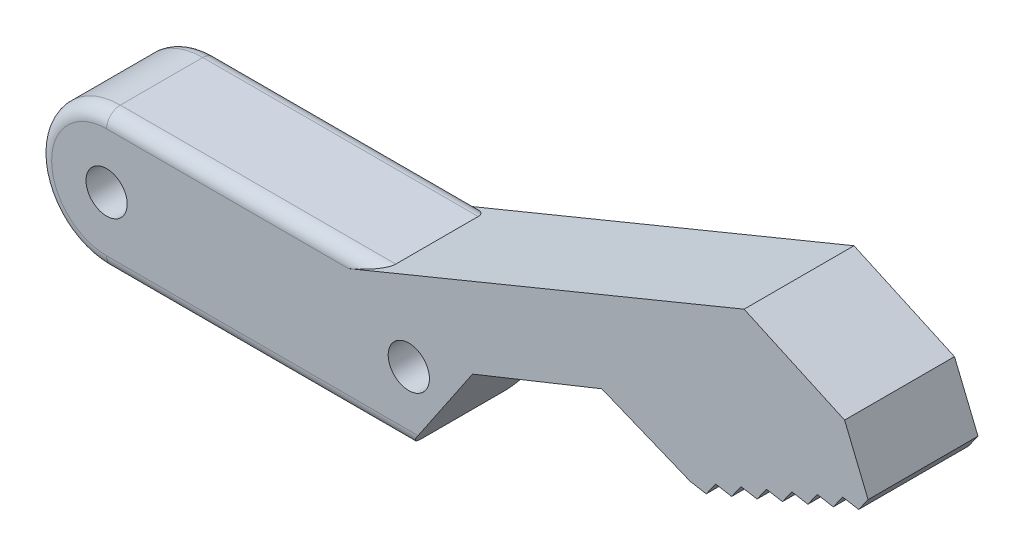
ISO-10303-21;
HEADER;
FILE_DESCRIPTION(('STEP AP214'),'2;1');
FILE_NAME('part.step','',(''),(''),'','','');
FILE_SCHEMA(('AUTOMOTIVE_DESIGN { 1 0 10303 214 1 1 1 1 }'));
ENDSEC;
DATA;
#1=APPLICATION_CONTEXT('core data for automotive mechanical design processes');
#2=APPLICATION_PROTOCOL_DEFINITION('international standard','automotive_design',2000,#1);
#3=PRODUCT_CONTEXT('',#1,'mechanical');
#4=PRODUCT('Part','Part','',(#3));
#5=PRODUCT_RELATED_PRODUCT_CATEGORY('part','',(#4));
#6=PRODUCT_DEFINITION_FORMATION('','',#4);
#7=PRODUCT_DEFINITION_CONTEXT('part definition',#1,'design');
#8=PRODUCT_DEFINITION('design','',#6,#7);
#9=PRODUCT_DEFINITION_SHAPE('','',#8);
#10=(LENGTH_UNIT() NAMED_UNIT(*) SI_UNIT(.MILLI.,.METRE.));
#11=(NAMED_UNIT(*) PLANE_ANGLE_UNIT() SI_UNIT($,.RADIAN.));
#12=(NAMED_UNIT(*) SI_UNIT($,.STERADIAN.) SOLID_ANGLE_UNIT());
#13=UNCERTAINTY_MEASURE_WITH_UNIT(LENGTH_MEASURE(1.E-05),#10,'distance_accuracy_value','');
#14=(GEOMETRIC_REPRESENTATION_CONTEXT(3) GLOBAL_UNCERTAINTY_ASSIGNED_CONTEXT((#13)) GLOBAL_UNIT_ASSIGNED_CONTEXT((#10,
#11,#12)) REPRESENTATION_CONTEXT('',''));
#15=CARTESIAN_POINT('',(0.,0.,0.));
#16=DIRECTION('',(0.,0.,1.));
#17=DIRECTION('',(1.,0.,0.));
#18=AXIS2_PLACEMENT_3D('',#15,#16,#17);
#19=CARTESIAN_POINT('',(17.4169423320841,-11.7775455324514,8.));
#20=DIRECTION('',(0.828382811153468,-0.560162403402333,0.));
#21=DIRECTION('',(0.560162403402333,0.828382811153468,0.));
#22=AXIS2_PLACEMENT_3D('',#19,#20,#21);
#23=PLANE('',#22);
#24=DIRECTION('',(-0.560162403402333,-0.828382811153468,0.));
#25=VECTOR('',#24,1.);
#26=CARTESIAN_POINT('',(17.4169423320841,-11.7775455324514,8.));
#27=LINE('',#26,#25);
#28=CARTESIAN_POINT('',(26.6402890643291,1.86218081814518,8.));
#29=VERTEX_POINT('',#28);
#30=CARTESIAN_POINT('',(22.6762120071304,-4.,8.));
#31=VERTEX_POINT('',#30);
#32=EDGE_CURVE('E224',#29,#31,#27,.T.);
#33=ORIENTED_EDGE('',*,*,#32,.T.);
#34=CARTESIAN_POINT('',(22.6762120071304,-4.,7.));
#35=DIRECTION('',(0.828382811153468,-0.560162403402333,0.));
#36=DIRECTION('',(-0.560162403402333,-0.828382811153468,0.));
#37=AXIS2_PLACEMENT_3D('',#34,#35,#36);
#38=ELLIPSE('',#37,1.2071713542771,1.);
#39=CARTESIAN_POINT('',(22.,-5.,7.));
#40=VERTEX_POINT('',#39);
#41=EDGE_CURVE('E503',#31,#40,#38,.T.);
#42=ORIENTED_EDGE('',*,*,#41,.T.);
#43=DIRECTION('',(0.,0.,-1.));
#44=VECTOR('',#43,1.);
#45=CARTESIAN_POINT('',(22.,-5.,8.));
#46=LINE('',#45,#44);
#47=CARTESIAN_POINT('',(22.,-5.,1.));
#48=VERTEX_POINT('',#47);
#49=EDGE_CURVE('E323',#40,#48,#46,.T.);
#50=ORIENTED_EDGE('',*,*,#49,.T.);
#51=CARTESIAN_POINT('',(22.6762120071304,-4.,1.));
#52=DIRECTION('',(0.828382811153468,-0.560162403402333,0.));
#53=DIRECTION('',(0.560162403402333,0.828382811153468,0.));
#54=AXIS2_PLACEMENT_3D('',#51,#52,#53);
#55=ELLIPSE('',#54,1.2071713542771,1.);
#56=CARTESIAN_POINT('',(22.6762120071304,-4.,0.));
#57=VERTEX_POINT('',#56);
#58=EDGE_CURVE('E500',#48,#57,#55,.T.);
#59=ORIENTED_EDGE('',*,*,#58,.T.);
#60=DIRECTION('',(-0.560162403402333,-0.828382811153468,0.));
#61=VECTOR('',#60,1.);
#62=CARTESIAN_POINT('',(17.4169423320841,-11.7775455324514,0.));
#63=LINE('',#62,#61);
#64=CARTESIAN_POINT('',(26.6402890643291,1.86218081814518,0.));
#65=VERTEX_POINT('',#64);
#66=EDGE_CURVE('E227',#65,#57,#63,.T.);
#67=ORIENTED_EDGE('',*,*,#66,.F.);
#68=DIRECTION('',(0.,0.,-1.));
#69=VECTOR('',#68,1.);
#70=CARTESIAN_POINT('',(26.6402890643291,1.86218081814518,8.));
#71=LINE('',#70,#69);
#72=EDGE_CURVE('E222',#29,#65,#71,.T.);
#73=ORIENTED_EDGE('',*,*,#72,.F.);
#74=EDGE_LOOP('',(#33,#42,#50,#59,#67,#73));
#75=FACE_BOUND('',#74,.T.);
#76=ADVANCED_FACE('F40',(#75),#23,.T.);
#77=CARTESIAN_POINT('',(3.05159131153168,-7.60413041189335,8.));
#78=DIRECTION('',(0.372436163629035,-0.928057812865819,0.));
#79=DIRECTION('',(0.928057812865819,0.372436163629035,0.));
#80=AXIS2_PLACEMENT_3D('',#77,#78,#79);
#81=PLANE('',#80);
#82=DIRECTION('',(-0.928057812865819,-0.372436163629035,0.));
#83=VECTOR('',#82,1.);
#84=CARTESIAN_POINT('',(3.05159131153168,-7.60413041189335,0.));
#85=LINE('',#84,#83);
#86=CARTESIAN_POINT('',(36.0495613416878,5.63818832644809,0.));
#87=VERTEX_POINT('',#86);
#88=EDGE_CURVE('E335',#87,#65,#85,.T.);
#89=ORIENTED_EDGE('',*,*,#88,.F.);
#90=DIRECTION('',(0.,0.,-1.));
#91=VECTOR('',#90,1.);
#92=CARTESIAN_POINT('',(36.0495613416878,5.63818832644809,8.));
#93=LINE('',#92,#91);
#94=CARTESIAN_POINT('',(36.0495613416878,5.63818832644809,8.));
#95=VERTEX_POINT('',#94);
#96=EDGE_CURVE('E234',#95,#87,#93,.T.);
#97=ORIENTED_EDGE('',*,*,#96,.F.);
#98=DIRECTION('',(-0.928057812865819,-0.372436163629035,0.));
#99=VECTOR('',#98,1.);
#100=CARTESIAN_POINT('',(3.05159131153168,-7.60413041189335,8.));
#101=LINE('',#100,#99);
#102=EDGE_CURVE('E241',#95,#29,#101,.T.);
#103=ORIENTED_EDGE('',*,*,#102,.T.);
#104=ORIENTED_EDGE('',*,*,#72,.T.);
#105=EDGE_LOOP('',(#89,#97,#103,#104));
#106=FACE_BOUND('',#105,.T.);
#107=ADVANCED_FACE('F248',(#106),#81,.T.);
#108=CARTESIAN_POINT('',(7.08534886984038,17.4193969684519,8.));
#109=DIRECTION('',(-0.37677497239331,-0.926304820336168,0.));
#110=DIRECTION('',(0.926304820336168,-0.37677497239331,0.));
#111=AXIS2_PLACEMENT_3D('',#108,#109,#110);
#112=PLANE('',#111);
#113=DIRECTION('',(-0.926304820336168,0.37677497239331,0.));
#114=VECTOR('',#113,1.);
#115=CARTESIAN_POINT('',(7.08534886984038,17.4193969684519,0.));
#116=LINE('',#115,#114);
#117=CARTESIAN_POINT('',(42.4889751127142,3.01895339152997,0.));
#118=VERTEX_POINT('',#117);
#119=EDGE_CURVE('E338',#118,#87,#116,.T.);
#120=ORIENTED_EDGE('',*,*,#119,.F.);
#121=DIRECTION('',(0.,0.,-1.));
#122=VECTOR('',#121,1.);
#123=CARTESIAN_POINT('',(42.4889751127142,3.01895339152997,8.));
#124=LINE('',#123,#122);
#125=CARTESIAN_POINT('',(42.4889751127142,3.01895339152997,8.));
#126=VERTEX_POINT('',#125);
#127=EDGE_CURVE('E481',#126,#118,#124,.T.);
#128=ORIENTED_EDGE('',*,*,#127,.F.);
#129=DIRECTION('',(-0.926304820336168,0.37677497239331,0.));
#130=VECTOR('',#129,1.);
#131=CARTESIAN_POINT('',(7.08534886984038,17.4193969684519,8.));
#132=LINE('',#131,#130);
#133=EDGE_CURVE('E250',#126,#95,#132,.T.);
#134=ORIENTED_EDGE('',*,*,#133,.T.);
#135=ORIENTED_EDGE('',*,*,#96,.T.);
#136=EDGE_LOOP('',(#120,#128,#134,#135));
#137=FACE_BOUND('',#136,.T.);
#138=ADVANCED_FACE('F635',(#137),#112,.T.);
#139=CARTESIAN_POINT('',(1.75554094448233,10.0994552397873,8.));
#140=DIRECTION('',(-0.171257275030365,-0.985226342395073,0.));
#141=DIRECTION('',(0.985226342395073,-0.171257275030365,0.));
#142=AXIS2_PLACEMENT_3D('',#139,#140,#141);
#143=PLANE('',#142);
#144=DIRECTION('',(-0.985226342395073,0.171257275030365,0.));
#145=VECTOR('',#144,1.);
#146=CARTESIAN_POINT('',(1.75554094448233,10.0994552397873,0.));
#147=LINE('',#146,#145);
#148=CARTESIAN_POINT('',(43.6534192909026,2.81654352051825,0.));
#149=VERTEX_POINT('',#148);
#150=EDGE_CURVE('E342',#149,#118,#147,.T.);
#151=ORIENTED_EDGE('',*,*,#150,.F.);
#152=DIRECTION('',(0.,0.,-1.));
#153=VECTOR('',#152,1.);
#154=CARTESIAN_POINT('',(43.6534192909026,2.81654352051825,8.));
#155=LINE('',#154,#153);
#156=CARTESIAN_POINT('',(43.6534192909026,2.81654352051825,8.));
#157=VERTEX_POINT('',#156);
#158=EDGE_CURVE('E478',#157,#149,#155,.T.);
#159=ORIENTED_EDGE('',*,*,#158,.F.);
#160=DIRECTION('',(-0.985226342395073,0.171257275030365,0.));
#161=VECTOR('',#160,1.);
#162=CARTESIAN_POINT('',(1.75554094448233,10.0994552397873,8.));
#163=LINE('',#162,#161);
#164=EDGE_CURVE('E253',#157,#126,#163,.T.);
#165=ORIENTED_EDGE('',*,*,#164,.T.);
#166=ORIENTED_EDGE('',*,*,#127,.T.);
#167=EDGE_LOOP('',(#151,#159,#165,#166));
#168=FACE_BOUND('',#167,.T.);
#169=ADVANCED_FACE('F632',(#168),#143,.T.);
#170=CARTESIAN_POINT('',(27.6460976469595,-19.6754472329708,8.));
#171=DIRECTION('',(0.814732571298572,-0.579836905746105,0.));
#172=DIRECTION('',(0.579836905746105,0.814732571298572,0.));
#173=AXIS2_PLACEMENT_3D('',#170,#171,#172);
#174=PLANE('',#173);
#175=DIRECTION('',(-0.579836905746105,-0.814732571298572,0.));
#176=VECTOR('',#175,1.);
#177=CARTESIAN_POINT('',(27.6460976469595,-19.6754472329708,0.));
#178=LINE('',#177,#176);
#179=CARTESIAN_POINT('',(44.3387315690473,3.77948021699638,0.));
#180=VERTEX_POINT('',#179);
#181=EDGE_CURVE('E346',#180,#149,#178,.T.);
#182=ORIENTED_EDGE('',*,*,#181,.F.);
#183=DIRECTION('',(0.,0.,-1.));
#184=VECTOR('',#183,1.);
#185=CARTESIAN_POINT('',(44.3387315690473,3.77948021699638,8.));
#186=LINE('',#185,#184);
#187=CARTESIAN_POINT('',(44.3387315690473,3.77948021699638,8.));
#188=VERTEX_POINT('',#187);
#189=EDGE_CURVE('E475',#188,#180,#186,.T.);
#190=ORIENTED_EDGE('',*,*,#189,.F.);
#191=DIRECTION('',(-0.579836905746105,-0.814732571298572,0.));
#192=VECTOR('',#191,1.);
#193=CARTESIAN_POINT('',(27.6460976469595,-19.6754472329708,8.));
#194=LINE('',#193,#192);
#195=EDGE_CURVE('E260',#188,#157,#194,.T.);
#196=ORIENTED_EDGE('',*,*,#195,.T.);
#197=ORIENTED_EDGE('',*,*,#158,.T.);
#198=EDGE_LOOP('',(#182,#190,#196,#197));
#199=FACE_BOUND('',#198,.T.);
#200=ADVANCED_FACE('F628',(#199),#174,.T.);
#201=CARTESIAN_POINT('',(1.93811409751749,11.1497807208651,8.));
#202=DIRECTION('',(-0.171257275030367,-0.985226342395073,0.));
#203=DIRECTION('',(0.985226342395073,-0.171257275030367,0.));
#204=AXIS2_PLACEMENT_3D('',#201,#202,#203);
#205=PLANE('',#204);
#206=DIRECTION('',(-0.985226342395073,0.171257275030367,0.));
#207=VECTOR('',#206,1.);
#208=CARTESIAN_POINT('',(1.93811409751749,11.1497807208651,0.));
#209=LINE('',#208,#207);
#210=CARTESIAN_POINT('',(45.5031757472357,3.57707034598466,0.));
#211=VERTEX_POINT('',#210);
#212=EDGE_CURVE('E350',#211,#180,#209,.T.);
#213=ORIENTED_EDGE('',*,*,#212,.F.);
#214=DIRECTION('',(0.,0.,-1.));
#215=VECTOR('',#214,1.);
#216=CARTESIAN_POINT('',(45.5031757472357,3.57707034598466,8.));
#217=LINE('',#216,#215);
#218=CARTESIAN_POINT('',(45.5031757472357,3.57707034598466,8.));
#219=VERTEX_POINT('',#218);
#220=EDGE_CURVE('E472',#219,#211,#217,.T.);
#221=ORIENTED_EDGE('',*,*,#220,.F.);
#222=DIRECTION('',(-0.985226342395073,0.171257275030367,0.));
#223=VECTOR('',#222,1.);
#224=CARTESIAN_POINT('',(1.93811409751749,11.1497807208651,8.));
#225=LINE('',#224,#223);
#226=EDGE_CURVE('E264',#219,#188,#225,.T.);
#227=ORIENTED_EDGE('',*,*,#226,.T.);
#228=ORIENTED_EDGE('',*,*,#189,.T.);
#229=EDGE_LOOP('',(#213,#221,#227,#228));
#230=FACE_BOUND('',#229,.T.);
#231=ADVANCED_FACE('F624',(#230),#205,.T.);
#232=CARTESIAN_POINT('',(28.514663927697,-20.2935970435959,8.));
#233=DIRECTION('',(0.81473257129857,-0.579836905746107,0.));
#234=DIRECTION('',(0.579836905746107,0.81473257129857,0.));
#235=AXIS2_PLACEMENT_3D('',#232,#233,#234);
#236=PLANE('',#235);
#237=DIRECTION('',(-0.579836905746107,-0.81473257129857,0.));
#238=VECTOR('',#237,1.);
#239=CARTESIAN_POINT('',(28.514663927697,-20.2935970435959,0.));
#240=LINE('',#239,#238);
#241=CARTESIAN_POINT('',(46.1884880253804,4.54000704246279,0.));
#242=VERTEX_POINT('',#241);
#243=EDGE_CURVE('E354',#242,#211,#240,.T.);
#244=ORIENTED_EDGE('',*,*,#243,.F.);
#245=DIRECTION('',(0.,0.,-1.));
#246=VECTOR('',#245,1.);
#247=CARTESIAN_POINT('',(46.1884880253804,4.54000704246279,8.));
#248=LINE('',#247,#246);
#249=CARTESIAN_POINT('',(46.1884880253804,4.54000704246279,8.));
#250=VERTEX_POINT('',#249);
#251=EDGE_CURVE('E469',#250,#242,#248,.T.);
#252=ORIENTED_EDGE('',*,*,#251,.F.);
#253=DIRECTION('',(-0.579836905746107,-0.81473257129857,0.));
#254=VECTOR('',#253,1.);
#255=CARTESIAN_POINT('',(28.514663927697,-20.2935970435959,8.));
#256=LINE('',#255,#254);
#257=EDGE_CURVE('E268',#250,#219,#256,.T.);
#258=ORIENTED_EDGE('',*,*,#257,.T.);
#259=ORIENTED_EDGE('',*,*,#220,.T.);
#260=EDGE_LOOP('',(#244,#252,#258,#259));
#261=FACE_BOUND('',#260,.T.);
#262=ADVANCED_FACE('F619',(#261),#236,.T.);
#263=CARTESIAN_POINT('',(2.12068725055261,12.2001062019428,8.));
#264=DIRECTION('',(0.171257275030367,0.985226342395073,0.));
#265=DIRECTION('',(-0.985226342395073,0.171257275030367,0.));
#266=AXIS2_PLACEMENT_3D('',#263,#264,#265);
#267=PLANE('',#266);
#268=DIRECTION('',(0.985226342395073,-0.171257275030367,0.));
#269=VECTOR('',#268,1.);
#270=CARTESIAN_POINT('',(2.12068725055261,12.2001062019428,0.));
#271=LINE('',#270,#269);
#272=CARTESIAN_POINT('',(47.3529322035688,4.33759717145107,0.));
#273=VERTEX_POINT('',#272);
#274=EDGE_CURVE('E358',#242,#273,#271,.T.);
#275=ORIENTED_EDGE('',*,*,#274,.T.);
#276=DIRECTION('',(0.,0.,-1.));
#277=VECTOR('',#276,1.);
#278=CARTESIAN_POINT('',(47.3529322035688,4.33759717145107,8.));
#279=LINE('',#278,#277);
#280=CARTESIAN_POINT('',(47.3529322035688,4.33759717145107,8.));
#281=VERTEX_POINT('',#280);
#282=EDGE_CURVE('E465',#281,#273,#279,.T.);
#283=ORIENTED_EDGE('',*,*,#282,.F.);
#284=DIRECTION('',(0.985226342395073,-0.171257275030367,0.));
#285=VECTOR('',#284,1.);
#286=CARTESIAN_POINT('',(2.12068725055261,12.2001062019428,8.));
#287=LINE('',#286,#285);
#288=EDGE_CURVE('E272',#250,#281,#287,.T.);
#289=ORIENTED_EDGE('',*,*,#288,.F.);
#290=ORIENTED_EDGE('',*,*,#251,.T.);
#291=EDGE_LOOP('',(#275,#283,#289,#290));
#292=FACE_BOUND('',#291,.T.);
#293=ADVANCED_FACE('F616',(#292),#267,.F.);
#294=CARTESIAN_POINT('',(29.3832302084347,-20.911746854221,8.));
#295=DIRECTION('',(-0.814732571298571,0.579836905746107,0.));
#296=DIRECTION('',(-0.579836905746107,-0.814732571298571,0.));
#297=AXIS2_PLACEMENT_3D('',#294,#295,#296);
#298=PLANE('',#297);
#299=DIRECTION('',(0.579836905746107,0.814732571298571,0.));
#300=VECTOR('',#299,1.);
#301=CARTESIAN_POINT('',(29.3832302084347,-20.911746854221,0.));
#302=LINE('',#301,#300);
#303=CARTESIAN_POINT('',(48.0382444817135,5.30053386792921,0.));
#304=VERTEX_POINT('',#303);
#305=EDGE_CURVE('E362',#273,#304,#302,.T.);
#306=ORIENTED_EDGE('',*,*,#305,.T.);
#307=DIRECTION('',(0.,0.,-1.));
#308=VECTOR('',#307,1.);
#309=CARTESIAN_POINT('',(48.0382444817135,5.30053386792921,8.));
#310=LINE('',#309,#308);
#311=CARTESIAN_POINT('',(48.0382444817135,5.30053386792921,8.));
#312=VERTEX_POINT('',#311);
#313=EDGE_CURVE('E461',#312,#304,#310,.T.);
#314=ORIENTED_EDGE('',*,*,#313,.F.);
#315=DIRECTION('',(0.579836905746107,0.814732571298571,0.));
#316=VECTOR('',#315,1.);
#317=CARTESIAN_POINT('',(29.3832302084347,-20.911746854221,8.));
#318=LINE('',#317,#316);
#319=EDGE_CURVE('E276',#281,#312,#318,.T.);
#320=ORIENTED_EDGE('',*,*,#319,.F.);
#321=ORIENTED_EDGE('',*,*,#282,.T.);
#322=EDGE_LOOP('',(#306,#314,#320,#321));
#323=FACE_BOUND('',#322,.T.);
#324=ADVANCED_FACE('F612',(#323),#298,.F.);
#325=CARTESIAN_POINT('',(2.30326040358772,13.2504316830205,8.));
#326=DIRECTION('',(0.171257275030366,0.985226342395073,0.));
#327=DIRECTION('',(-0.985226342395073,0.171257275030366,0.));
#328=AXIS2_PLACEMENT_3D('',#325,#326,#327);
#329=PLANE('',#328);
#330=DIRECTION('',(0.985226342395073,-0.171257275030366,0.));
#331=VECTOR('',#330,1.);
#332=CARTESIAN_POINT('',(2.30326040358772,13.2504316830205,0.));
#333=LINE('',#332,#331);
#334=CARTESIAN_POINT('',(49.2026886599019,5.09812399691749,0.));
#335=VERTEX_POINT('',#334);
#336=EDGE_CURVE('E366',#304,#335,#333,.T.);
#337=ORIENTED_EDGE('',*,*,#336,.T.);
#338=DIRECTION('',(0.,0.,-1.));
#339=VECTOR('',#338,1.);
#340=CARTESIAN_POINT('',(49.2026886599019,5.09812399691749,8.));
#341=LINE('',#340,#339);
#342=CARTESIAN_POINT('',(49.2026886599019,5.09812399691749,8.));
#343=VERTEX_POINT('',#342);
#344=EDGE_CURVE('E457',#343,#335,#341,.T.);
#345=ORIENTED_EDGE('',*,*,#344,.F.);
#346=DIRECTION('',(0.985226342395073,-0.171257275030366,0.));
#347=VECTOR('',#346,1.);
#348=CARTESIAN_POINT('',(2.30326040358772,13.2504316830205,8.));
#349=LINE('',#348,#347);
#350=EDGE_CURVE('E280',#312,#343,#349,.T.);
#351=ORIENTED_EDGE('',*,*,#350,.F.);
#352=ORIENTED_EDGE('',*,*,#313,.T.);
#353=EDGE_LOOP('',(#337,#345,#351,#352));
#354=FACE_BOUND('',#353,.T.);
#355=ADVANCED_FACE('F610',(#354),#329,.F.);
#356=CARTESIAN_POINT('',(30.2517964891723,-21.5298966648462,8.));
#357=DIRECTION('',(-0.81473257129857,0.579836905746107,0.));
#358=DIRECTION('',(-0.579836905746107,-0.81473257129857,0.));
#359=AXIS2_PLACEMENT_3D('',#356,#357,#358);
#360=PLANE('',#359);
#361=DIRECTION('',(0.579836905746107,0.81473257129857,0.));
#362=VECTOR('',#361,1.);
#363=CARTESIAN_POINT('',(30.2517964891723,-21.5298966648462,0.));
#364=LINE('',#363,#362);
#365=CARTESIAN_POINT('',(49.8880009380466,6.06106069339563,0.));
#366=VERTEX_POINT('',#365);
#367=EDGE_CURVE('E370',#335,#366,#364,.T.);
#368=ORIENTED_EDGE('',*,*,#367,.T.);
#369=DIRECTION('',(0.,0.,-1.));
#370=VECTOR('',#369,1.);
#371=CARTESIAN_POINT('',(49.8880009380466,6.06106069339563,8.));
#372=LINE('',#371,#370);
#373=CARTESIAN_POINT('',(49.8880009380466,6.06106069339563,8.));
#374=VERTEX_POINT('',#373);
#375=EDGE_CURVE('E453',#374,#366,#372,.T.);
#376=ORIENTED_EDGE('',*,*,#375,.F.);
#377=DIRECTION('',(0.579836905746107,0.81473257129857,0.));
#378=VECTOR('',#377,1.);
#379=CARTESIAN_POINT('',(30.2517964891723,-21.5298966648462,8.));
#380=LINE('',#379,#378);
#381=EDGE_CURVE('E284',#343,#374,#380,.T.);
#382=ORIENTED_EDGE('',*,*,#381,.F.);
#383=ORIENTED_EDGE('',*,*,#344,.T.);
#384=EDGE_LOOP('',(#368,#376,#382,#383));
#385=FACE_BOUND('',#384,.T.);
#386=ADVANCED_FACE('F605',(#385),#360,.F.);
#387=CARTESIAN_POINT('',(2.48583355662286,14.3007571640983,8.));
#388=DIRECTION('',(0.171257275030367,0.985226342395073,0.));
#389=DIRECTION('',(-0.985226342395073,0.171257275030367,0.));
#390=AXIS2_PLACEMENT_3D('',#387,#388,#389);
#391=PLANE('',#390);
#392=DIRECTION('',(0.985226342395073,-0.171257275030367,0.));
#393=VECTOR('',#392,1.);
#394=CARTESIAN_POINT('',(2.48583355662286,14.3007571640983,0.));
#395=LINE('',#394,#393);
#396=CARTESIAN_POINT('',(51.052445116235,5.85865082238391,0.));
#397=VERTEX_POINT('',#396);
#398=EDGE_CURVE('E374',#366,#397,#395,.T.);
#399=ORIENTED_EDGE('',*,*,#398,.T.);
#400=DIRECTION('',(0.,0.,-1.));
#401=VECTOR('',#400,1.);
#402=CARTESIAN_POINT('',(51.052445116235,5.85865082238391,8.));
#403=LINE('',#402,#401);
#404=CARTESIAN_POINT('',(51.052445116235,5.85865082238391,8.));
#405=VERTEX_POINT('',#404);
#406=EDGE_CURVE('E449',#405,#397,#403,.T.);
#407=ORIENTED_EDGE('',*,*,#406,.F.);
#408=DIRECTION('',(0.985226342395073,-0.171257275030367,0.));
#409=VECTOR('',#408,1.);
#410=CARTESIAN_POINT('',(2.48583355662286,14.3007571640983,8.));
#411=LINE('',#410,#409);
#412=EDGE_CURVE('E288',#374,#405,#411,.T.);
#413=ORIENTED_EDGE('',*,*,#412,.F.);
#414=ORIENTED_EDGE('',*,*,#375,.T.);
#415=EDGE_LOOP('',(#399,#407,#413,#414));
#416=FACE_BOUND('',#415,.T.);
#417=ADVANCED_FACE('F602',(#416),#391,.F.);
#418=CARTESIAN_POINT('',(31.12036276991,-22.1480464754713,8.));
#419=DIRECTION('',(-0.81473257129857,0.579836905746108,0.));
#420=DIRECTION('',(-0.579836905746108,-0.81473257129857,0.));
#421=AXIS2_PLACEMENT_3D('',#418,#419,#420);
#422=PLANE('',#421);
#423=DIRECTION('',(0.579836905746108,0.81473257129857,0.));
#424=VECTOR('',#423,1.);
#425=CARTESIAN_POINT('',(31.12036276991,-22.1480464754713,0.));
#426=LINE('',#425,#424);
#427=CARTESIAN_POINT('',(51.7377573943797,6.82158751886204,0.));
#428=VERTEX_POINT('',#427);
#429=EDGE_CURVE('E378',#397,#428,#426,.T.);
#430=ORIENTED_EDGE('',*,*,#429,.T.);
#431=DIRECTION('',(0.,0.,-1.));
#432=VECTOR('',#431,1.);
#433=CARTESIAN_POINT('',(51.7377573943797,6.82158751886204,8.));
#434=LINE('',#433,#432);
#435=CARTESIAN_POINT('',(51.7377573943797,6.82158751886204,8.));
#436=VERTEX_POINT('',#435);
#437=EDGE_CURVE('E445',#436,#428,#434,.T.);
#438=ORIENTED_EDGE('',*,*,#437,.F.);
#439=DIRECTION('',(0.579836905746108,0.81473257129857,0.));
#440=VECTOR('',#439,1.);
#441=CARTESIAN_POINT('',(31.12036276991,-22.1480464754713,8.));
#442=LINE('',#441,#440);
#443=EDGE_CURVE('E292',#405,#436,#442,.T.);
#444=ORIENTED_EDGE('',*,*,#443,.F.);
#445=ORIENTED_EDGE('',*,*,#406,.T.);
#446=EDGE_LOOP('',(#430,#438,#444,#445));
#447=FACE_BOUND('',#446,.T.);
#448=ADVANCED_FACE('F600',(#447),#422,.F.);
#449=CARTESIAN_POINT('',(2.66840670965807,15.3510826451762,8.));
#450=DIRECTION('',(0.171257275030371,0.985226342395072,0.));
#451=DIRECTION('',(-0.985226342395072,0.171257275030371,0.));
#452=AXIS2_PLACEMENT_3D('',#449,#450,#451);
#453=PLANE('',#452);
#454=DIRECTION('',(0.985226342395072,-0.171257275030371,0.));
#455=VECTOR('',#454,1.);
#456=CARTESIAN_POINT('',(2.66840670965807,15.3510826451762,0.));
#457=LINE('',#456,#455);
#458=CARTESIAN_POINT('',(52.9022015725681,6.61917764785032,0.));
#459=VERTEX_POINT('',#458);
#460=EDGE_CURVE('E382',#428,#459,#457,.T.);
#461=ORIENTED_EDGE('',*,*,#460,.T.);
#462=DIRECTION('',(0.,0.,-1.));
#463=VECTOR('',#462,1.);
#464=CARTESIAN_POINT('',(52.9022015725681,6.61917764785032,8.));
#465=LINE('',#464,#463);
#466=CARTESIAN_POINT('',(52.9022015725681,6.61917764785032,8.));
#467=VERTEX_POINT('',#466);
#468=EDGE_CURVE('E441',#467,#459,#465,.T.);
#469=ORIENTED_EDGE('',*,*,#468,.F.);
#470=DIRECTION('',(0.985226342395072,-0.171257275030371,0.));
#471=VECTOR('',#470,1.);
#472=CARTESIAN_POINT('',(2.66840670965807,15.3510826451762,8.));
#473=LINE('',#472,#471);
#474=EDGE_CURVE('E296',#436,#467,#473,.T.);
#475=ORIENTED_EDGE('',*,*,#474,.F.);
#476=ORIENTED_EDGE('',*,*,#437,.T.);
#477=EDGE_LOOP('',(#461,#469,#475,#476));
#478=FACE_BOUND('',#477,.T.);
#479=ADVANCED_FACE('F596',(#478),#453,.F.);
#480=CARTESIAN_POINT('',(31.988929050648,-22.7661962860964,8.));
#481=DIRECTION('',(-0.814732571298574,0.579836905746103,0.));
#482=DIRECTION('',(-0.579836905746103,-0.814732571298574,0.));
#483=AXIS2_PLACEMENT_3D('',#480,#481,#482);
#484=PLANE('',#483);
#485=DIRECTION('',(0.579836905746103,0.814732571298574,0.));
#486=VECTOR('',#485,1.);
#487=CARTESIAN_POINT('',(31.988929050648,-22.7661962860964,0.));
#488=LINE('',#487,#486);
#489=CARTESIAN_POINT('',(53.5875138507128,7.58211434432846,0.));
#490=VERTEX_POINT('',#489);
#491=EDGE_CURVE('E386',#459,#490,#488,.T.);
#492=ORIENTED_EDGE('',*,*,#491,.T.);
#493=DIRECTION('',(0.,0.,-1.));
#494=VECTOR('',#493,1.);
#495=CARTESIAN_POINT('',(53.5875138507128,7.58211434432846,8.));
#496=LINE('',#495,#494);
#497=CARTESIAN_POINT('',(53.5875138507128,7.58211434432846,8.));
#498=VERTEX_POINT('',#497);
#499=EDGE_CURVE('E437',#498,#490,#496,.T.);
#500=ORIENTED_EDGE('',*,*,#499,.F.);
#501=DIRECTION('',(0.579836905746103,0.814732571298574,0.));
#502=VECTOR('',#501,1.);
#503=CARTESIAN_POINT('',(31.988929050648,-22.7661962860964,8.));
#504=LINE('',#503,#502);
#505=EDGE_CURVE('E300',#467,#498,#504,.T.);
#506=ORIENTED_EDGE('',*,*,#505,.F.);
#507=ORIENTED_EDGE('',*,*,#468,.T.);
#508=EDGE_LOOP('',(#492,#500,#506,#507));
#509=FACE_BOUND('',#508,.T.);
#510=ADVANCED_FACE('F593',(#509),#484,.F.);
#511=CARTESIAN_POINT('',(2.85097986269345,16.4014081262544,8.));
#512=DIRECTION('',(0.171257275030381,0.98522634239507,0.));
#513=DIRECTION('',(-0.98522634239507,0.171257275030381,0.));
#514=AXIS2_PLACEMENT_3D('',#511,#512,#513);
#515=PLANE('',#514);
#516=DIRECTION('',(0.98522634239507,-0.171257275030381,0.));
#517=VECTOR('',#516,1.);
#518=CARTESIAN_POINT('',(2.85097986269345,16.4014081262544,0.));
#519=LINE('',#518,#517);
#520=CARTESIAN_POINT('',(54.7519580289012,7.37970447331672,0.));
#521=VERTEX_POINT('',#520);
#522=EDGE_CURVE('E390',#490,#521,#519,.T.);
#523=ORIENTED_EDGE('',*,*,#522,.T.);
#524=DIRECTION('',(0.,0.,-1.));
#525=VECTOR('',#524,1.);
#526=CARTESIAN_POINT('',(54.7519580289012,7.37970447331672,8.));
#527=LINE('',#526,#525);
#528=CARTESIAN_POINT('',(54.7519580289012,7.37970447331672,8.));
#529=VERTEX_POINT('',#528);
#530=EDGE_CURVE('E433',#529,#521,#527,.T.);
#531=ORIENTED_EDGE('',*,*,#530,.F.);
#532=DIRECTION('',(0.98522634239507,-0.171257275030381,0.));
#533=VECTOR('',#532,1.);
#534=CARTESIAN_POINT('',(2.85097986269345,16.4014081262544,8.));
#535=LINE('',#534,#533);
#536=EDGE_CURVE('E304',#498,#529,#535,.T.);
#537=ORIENTED_EDGE('',*,*,#536,.F.);
#538=ORIENTED_EDGE('',*,*,#499,.T.);
#539=EDGE_LOOP('',(#523,#531,#537,#538));
#540=FACE_BOUND('',#539,.T.);
#541=ADVANCED_FACE('F591',(#540),#515,.F.);
#542=CARTESIAN_POINT('',(32.8574953313856,-23.3843460967215,8.));
#543=DIRECTION('',(-0.814732571298573,0.579836905746103,0.));
#544=DIRECTION('',(-0.579836905746103,-0.814732571298573,0.));
#545=AXIS2_PLACEMENT_3D('',#542,#543,#544);
#546=PLANE('',#545);
#547=DIRECTION('',(0.579836905746103,0.814732571298573,0.));
#548=VECTOR('',#547,1.);
#549=CARTESIAN_POINT('',(32.8574953313856,-23.3843460967215,0.));
#550=LINE('',#549,#548);
#551=CARTESIAN_POINT('',(55.4372703070458,8.34264116979486,0.));
#552=VERTEX_POINT('',#551);
#553=EDGE_CURVE('E394',#521,#552,#550,.T.);
#554=ORIENTED_EDGE('',*,*,#553,.T.);
#555=DIRECTION('',(0.,0.,-1.));
#556=VECTOR('',#555,1.);
#557=CARTESIAN_POINT('',(55.4372703070458,8.34264116979486,8.));
#558=LINE('',#557,#556);
#559=CARTESIAN_POINT('',(55.4372703070458,8.34264116979486,8.));
#560=VERTEX_POINT('',#559);
#561=EDGE_CURVE('E430',#560,#552,#558,.T.);
#562=ORIENTED_EDGE('',*,*,#561,.F.);
#563=DIRECTION('',(0.579836905746103,0.814732571298573,0.));
#564=VECTOR('',#563,1.);
#565=CARTESIAN_POINT('',(32.8574953313856,-23.3843460967215,8.));
#566=LINE('',#565,#564);
#567=EDGE_CURVE('E308',#529,#560,#566,.T.);
#568=ORIENTED_EDGE('',*,*,#567,.F.);
#569=ORIENTED_EDGE('',*,*,#530,.T.);
#570=EDGE_LOOP('',(#554,#562,#568,#569));
#571=FACE_BOUND('',#570,.T.);
#572=ADVANCED_FACE('F587',(#571),#546,.F.);
#573=CARTESIAN_POINT('',(50.3551112402656,20.703489243922,8.));
#574=DIRECTION('',(0.924878228166548,0.380263412733209,0.));
#575=DIRECTION('',(-0.380263412733209,0.924878228166548,0.));
#576=AXIS2_PLACEMENT_3D('',#573,#574,#575);
#577=PLANE('',#576);
#578=DIRECTION('',(0.380263412733209,-0.924878228166548,0.));
#579=VECTOR('',#578,1.);
#580=CARTESIAN_POINT('',(50.3551112402656,20.703489243922,0.));
#581=LINE('',#580,#579);
#582=CARTESIAN_POINT('',(53.7260849497464,12.5045931965443,0.));
#583=VERTEX_POINT('',#582);
#584=EDGE_CURVE('E398',#583,#552,#581,.T.);
#585=ORIENTED_EDGE('',*,*,#584,.F.);
#586=DIRECTION('',(0.,0.,-1.));
#587=VECTOR('',#586,1.);
#588=CARTESIAN_POINT('',(53.7260849497464,12.5045931965443,8.));
#589=LINE('',#588,#587);
#590=CARTESIAN_POINT('',(53.7260849497464,12.5045931965443,8.));
#591=VERTEX_POINT('',#590);
#592=EDGE_CURVE('E427',#591,#583,#589,.T.);
#593=ORIENTED_EDGE('',*,*,#592,.F.);
#594=DIRECTION('',(0.380263412733209,-0.924878228166548,0.));
#595=VECTOR('',#594,1.);
#596=CARTESIAN_POINT('',(50.3551112402656,20.703489243922,8.));
#597=LINE('',#596,#595);
#598=EDGE_CURVE('E311',#591,#560,#597,.T.);
#599=ORIENTED_EDGE('',*,*,#598,.T.);
#600=ORIENTED_EDGE('',*,*,#561,.T.);
#601=EDGE_LOOP('',(#585,#593,#599,#600));
#602=FACE_BOUND('',#601,.T.);
#603=ADVANCED_FACE('F584',(#602),#577,.T.);
#604=CARTESIAN_POINT('',(13.9488099268583,30.6231164748254,8.));
#605=DIRECTION('',(0.414522259932087,0.910039172794663,0.));
#606=DIRECTION('',(-0.910039172794663,0.414522259932087,0.));
#607=AXIS2_PLACEMENT_3D('',#604,#605,#606);
#608=PLANE('',#607);
#609=DIRECTION('',(0.910039172794663,-0.414522259932087,0.));
#610=VECTOR('',#609,1.);
#611=CARTESIAN_POINT('',(13.9488099268583,30.6231164748254,0.));
#612=LINE('',#611,#610);
#613=CARTESIAN_POINT('',(46.4090295027466,15.8375072628964,0.));
#614=VERTEX_POINT('',#613);
#615=EDGE_CURVE('E402',#614,#583,#612,.T.);
#616=ORIENTED_EDGE('',*,*,#615,.F.);
#617=DIRECTION('',(0.,0.,-1.));
#618=VECTOR('',#617,1.);
#619=CARTESIAN_POINT('',(46.4090295027466,15.8375072628964,8.));
#620=LINE('',#619,#618);
#621=CARTESIAN_POINT('',(46.4090295027466,15.8375072628964,8.));
#622=VERTEX_POINT('',#621);
#623=EDGE_CURVE('E424',#622,#614,#620,.T.);
#624=ORIENTED_EDGE('',*,*,#623,.F.);
#625=DIRECTION('',(0.910039172794663,-0.414522259932087,0.));
#626=VECTOR('',#625,1.);
#627=CARTESIAN_POINT('',(13.9488099268583,30.6231164748254,8.));
#628=LINE('',#627,#626);
#629=EDGE_CURVE('E315',#622,#591,#628,.T.);
#630=ORIENTED_EDGE('',*,*,#629,.T.);
#631=ORIENTED_EDGE('',*,*,#592,.T.);
#632=EDGE_LOOP('',(#616,#624,#630,#631));
#633=FACE_BOUND('',#632,.T.);
#634=ADVANCED_FACE('F580',(#633),#608,.T.);
#635=CARTESIAN_POINT('',(1.14074851739701,-2.77453321099285,8.));
#636=DIRECTION('',(-0.380263412733207,0.924878228166549,0.));
#637=DIRECTION('',(-0.924878228166549,-0.380263412733207,0.));
#638=AXIS2_PLACEMENT_3D('',#635,#636,#637);
#639=PLANE('',#638);
#640=DIRECTION('',(0.924878228166549,0.380263412733207,0.));
#641=VECTOR('',#640,1.);
#642=CARTESIAN_POINT('',(1.14074851739701,-2.77453321099285,0.));
#643=LINE('',#642,#641);
#644=CARTESIAN_POINT('',(17.6177959088443,4.,0.));
#645=VERTEX_POINT('',#644);
#646=EDGE_CURVE('E57',#645,#614,#643,.T.);
#647=ORIENTED_EDGE('',*,*,#646,.F.);
#648=CARTESIAN_POINT('',(17.6177959088443,4.,1.));
#649=DIRECTION('',(-0.380263412733207,0.924878228166549,0.));
#650=DIRECTION('',(-0.924878228166549,-0.380263412733207,0.));
#651=AXIS2_PLACEMENT_3D('',#648,#649,#650);
#652=ELLIPSE('',#651,2.62975602310076,1.);
#653=CARTESIAN_POINT('',(20.05,5.,1.));
#654=VERTEX_POINT('',#653);
#655=EDGE_CURVE('E11',#645,#654,#652,.F.);
#656=ORIENTED_EDGE('',*,*,#655,.T.);
#657=DIRECTION('',(0.,0.,-1.));
#658=VECTOR('',#657,1.);
#659=CARTESIAN_POINT('',(20.05,5.,8.));
#660=LINE('',#659,#658);
#661=CARTESIAN_POINT('',(20.05,5.,7.));
#662=VERTEX_POINT('',#661);
#663=EDGE_CURVE('E420',#662,#654,#660,.T.);
#664=ORIENTED_EDGE('',*,*,#663,.F.);
#665=CARTESIAN_POINT('',(17.6177959088443,4.,7.));
#666=DIRECTION('',(-0.380263412733207,0.924878228166549,0.));
#667=DIRECTION('',(0.924878228166549,0.380263412733207,0.));
#668=AXIS2_PLACEMENT_3D('',#665,#666,#667);
#669=ELLIPSE('',#668,2.62975602310076,1.);
#670=CARTESIAN_POINT('',(17.6177959088443,4.,8.));
#671=VERTEX_POINT('',#670);
#672=EDGE_CURVE('E50',#662,#671,#669,.F.);
#673=ORIENTED_EDGE('',*,*,#672,.T.);
#674=DIRECTION('',(0.924878228166549,0.380263412733207,0.));
#675=VECTOR('',#674,1.);
#676=CARTESIAN_POINT('',(1.14074851739701,-2.77453321099285,8.));
#677=LINE('',#676,#675);
#678=EDGE_CURVE('E319',#671,#622,#677,.T.);
#679=ORIENTED_EDGE('',*,*,#678,.T.);
#680=ORIENTED_EDGE('',*,*,#623,.T.);
#681=EDGE_LOOP('',(#647,#656,#664,#673,#679,#680));
#682=FACE_BOUND('',#681,.T.);
#683=ADVANCED_FACE('F574',(#682),#639,.T.);
#684=CARTESIAN_POINT('',(0.,5.,8.));
#685=DIRECTION('',(0.,1.,0.));
#686=DIRECTION('',(0.,0.,1.));
#687=AXIS2_PLACEMENT_3D('',#684,#685,#686);
#688=PLANE('',#687);
#689=DIRECTION('',(0.,0.,-1.));
#690=VECTOR('',#689,1.);
#691=CARTESIAN_POINT('',(0.,5.,8.));
#692=LINE('',#691,#690);
#693=CARTESIAN_POINT('',(0.,5.,7.));
#694=VERTEX_POINT('',#693);
#695=CARTESIAN_POINT('',(0.,5.,1.));
#696=VERTEX_POINT('',#695);
#697=EDGE_CURVE('E416',#694,#696,#692,.T.);
#698=ORIENTED_EDGE('',*,*,#697,.F.);
#699=DIRECTION('',(1.,0.,0.));
#700=VECTOR('',#699,1.);
#701=CARTESIAN_POINT('',(0.,5.,7.));
#702=LINE('',#701,#700);
#703=EDGE_CURVE('E488',#694,#662,#702,.T.);
#704=ORIENTED_EDGE('',*,*,#703,.T.);
#705=ORIENTED_EDGE('',*,*,#663,.T.);
#706=DIRECTION('',(1.,0.,0.));
#707=VECTOR('',#706,1.);
#708=CARTESIAN_POINT('',(0.,5.,1.));
#709=LINE('',#708,#707);
#710=EDGE_CURVE('E233',#654,#696,#709,.F.);
#711=ORIENTED_EDGE('',*,*,#710,.T.);
#712=EDGE_LOOP('',(#698,#704,#705,#711));
#713=FACE_BOUND('',#712,.T.);
#714=ADVANCED_FACE('F565',(#713),#688,.T.);
#715=CARTESIAN_POINT('',(0.,0.,8.));
#716=DIRECTION('',(0.,0.,-1.));
#717=DIRECTION('',(-1.,0.,0.));
#718=AXIS2_PLACEMENT_3D('',#715,#716,#717);
#719=CYLINDRICAL_SURFACE('',#718,5.);
#720=DIRECTION('',(0.,0.,-1.));
#721=VECTOR('',#720,1.);
#722=CARTESIAN_POINT('',(0.,-5.,8.));
#723=LINE('',#722,#721);
#724=CARTESIAN_POINT('',(0.,-5.,7.));
#725=VERTEX_POINT('',#724);
#726=CARTESIAN_POINT('',(0.,-5.,1.));
#727=VERTEX_POINT('',#726);
#728=EDGE_CURVE('E412',#725,#727,#723,.T.);
#729=ORIENTED_EDGE('',*,*,#728,.F.);
#730=CARTESIAN_POINT('',(0.,0.,7.));
#731=DIRECTION('',(0.,0.,1.));
#732=DIRECTION('',(1.,0.,0.));
#733=AXIS2_PLACEMENT_3D('',#730,#731,#732);
#734=CIRCLE('',#733,5.);
#735=EDGE_CURVE('E523',#725,#694,#734,.F.);
#736=ORIENTED_EDGE('',*,*,#735,.T.);
#737=ORIENTED_EDGE('',*,*,#697,.T.);
#738=CARTESIAN_POINT('',(0.,0.,1.));
#739=DIRECTION('',(0.,0.,1.));
#740=DIRECTION('',(1.,0.,0.));
#741=AXIS2_PLACEMENT_3D('',#738,#739,#740);
#742=CIRCLE('',#741,5.);
#743=EDGE_CURVE('E520',#696,#727,#742,.T.);
#744=ORIENTED_EDGE('',*,*,#743,.T.);
#745=EDGE_LOOP('',(#729,#736,#737,#744));
#746=FACE_BOUND('',#745,.T.);
#747=ADVANCED_FACE('F561',(#746),#719,.T.);
#748=CARTESIAN_POINT('',(0.,0.,8.));
#749=DIRECTION('',(0.,0.,-1.));
#750=DIRECTION('',(-1.,0.,0.));
#751=AXIS2_PLACEMENT_3D('',#748,#749,#750);
#752=CYLINDRICAL_SURFACE('',#751,1.5);
#753=CARTESIAN_POINT('',(0.,0.,8.));
#754=DIRECTION('',(0.,0.,1.));
#755=DIRECTION('',(1.,0.,0.));
#756=AXIS2_PLACEMENT_3D('',#753,#754,#755);
#757=CIRCLE('',#756,1.5);
#758=CARTESIAN_POINT('',(1.5,0.,8.));
#759=VERTEX_POINT('',#758);
#760=EDGE_CURVE('E246',#759,#759,#757,.T.);
#761=ORIENTED_EDGE('',*,*,#760,.T.);
#762=EDGE_LOOP('',(#761));
#763=FACE_BOUND('',#762,.T.);
#764=CARTESIAN_POINT('',(0.,0.,0.));
#765=DIRECTION('',(0.,0.,1.));
#766=DIRECTION('',(1.,0.,0.));
#767=AXIS2_PLACEMENT_3D('',#764,#765,#766);
#768=CIRCLE('',#767,1.5);
#769=CARTESIAN_POINT('',(1.5,0.,0.));
#770=VERTEX_POINT('',#769);
#771=EDGE_CURVE('E328',#770,#770,#768,.T.);
#772=ORIENTED_EDGE('',*,*,#771,.F.);
#773=EDGE_LOOP('',(#772));
#774=FACE_BOUND('',#773,.T.);
#775=ADVANCED_FACE('F649',(#763,#774),#752,.F.);
#776=CARTESIAN_POINT('',(22.,0.,8.));
#777=DIRECTION('',(0.,0.,-1.));
#778=DIRECTION('',(-1.,0.,0.));
#779=AXIS2_PLACEMENT_3D('',#776,#777,#778);
#780=CYLINDRICAL_SURFACE('',#779,1.5);
#781=CARTESIAN_POINT('',(22.,0.,8.));
#782=DIRECTION('',(0.,0.,1.));
#783=DIRECTION('',(1.,0.,0.));
#784=AXIS2_PLACEMENT_3D('',#781,#782,#783);
#785=CIRCLE('',#784,1.5);
#786=CARTESIAN_POINT('',(23.5,0.,8.));
#787=VERTEX_POINT('',#786);
#788=EDGE_CURVE('E408',#787,#787,#785,.T.);
#789=ORIENTED_EDGE('',*,*,#788,.T.);
#790=EDGE_LOOP('',(#789));
#791=FACE_BOUND('',#790,.T.);
#792=CARTESIAN_POINT('',(22.,0.,0.));
#793=DIRECTION('',(0.,0.,1.));
#794=DIRECTION('',(1.,0.,0.));
#795=AXIS2_PLACEMENT_3D('',#792,#793,#794);
#796=CIRCLE('',#795,1.5);
#797=CARTESIAN_POINT('',(23.5,0.,0.));
#798=VERTEX_POINT('',#797);
#799=EDGE_CURVE('E324',#798,#798,#796,.T.);
#800=ORIENTED_EDGE('',*,*,#799,.F.);
#801=EDGE_LOOP('',(#800));
#802=FACE_BOUND('',#801,.T.);
#803=ADVANCED_FACE('F652',(#791,#802),#780,.F.);
#804=CARTESIAN_POINT('',(0.,-5.,8.));
#805=DIRECTION('',(0.,1.,0.));
#806=DIRECTION('',(0.,0.,1.));
#807=AXIS2_PLACEMENT_3D('',#804,#805,#806);
#808=PLANE('',#807);
#809=ORIENTED_EDGE('',*,*,#49,.F.);
#810=DIRECTION('',(1.,0.,0.));
#811=VECTOR('',#810,1.);
#812=CARTESIAN_POINT('',(0.,-5.,7.));
#813=LINE('',#812,#811);
#814=EDGE_CURVE('E509',#40,#725,#813,.F.);
#815=ORIENTED_EDGE('',*,*,#814,.T.);
#816=ORIENTED_EDGE('',*,*,#728,.T.);
#817=DIRECTION('',(1.,0.,0.));
#818=VECTOR('',#817,1.);
#819=CARTESIAN_POINT('',(0.,-5.,1.));
#820=LINE('',#819,#818);
#821=EDGE_CURVE('E506',#727,#48,#820,.T.);
#822=ORIENTED_EDGE('',*,*,#821,.T.);
#823=EDGE_LOOP('',(#809,#815,#816,#822));
#824=FACE_BOUND('',#823,.T.);
#825=ADVANCED_FACE('F553',(#824),#808,.F.);
#826=CARTESIAN_POINT('',(0.,0.,8.));
#827=DIRECTION('',(0.,0.,1.));
#828=DIRECTION('',(1.,0.,0.));
#829=AXIS2_PLACEMENT_3D('',#826,#827,#828);
#830=PLANE('',#829);
#831=ORIENTED_EDGE('',*,*,#678,.F.);
#832=DIRECTION('',(1.,0.,0.));
#833=VECTOR('',#832,1.);
#834=CARTESIAN_POINT('',(0.,4.,8.));
#835=LINE('',#834,#833);
#836=CARTESIAN_POINT('',(0.,4.,8.));
#837=VERTEX_POINT('',#836);
#838=EDGE_CURVE('E497',#671,#837,#835,.F.);
#839=ORIENTED_EDGE('',*,*,#838,.T.);
#840=CARTESIAN_POINT('',(0.,0.,8.));
#841=DIRECTION('',(0.,0.,1.));
#842=DIRECTION('',(1.,0.,0.));
#843=AXIS2_PLACEMENT_3D('',#840,#841,#842);
#844=CIRCLE('',#843,4.);
#845=CARTESIAN_POINT('',(0.,-4.,8.));
#846=VERTEX_POINT('',#845);
#847=EDGE_CURVE('E492',#837,#846,#844,.T.);
#848=ORIENTED_EDGE('',*,*,#847,.T.);
#849=DIRECTION('',(1.,0.,0.));
#850=VECTOR('',#849,1.);
#851=CARTESIAN_POINT('',(22.,-4.,8.));
#852=LINE('',#851,#850);
#853=EDGE_CURVE('E244',#846,#31,#852,.T.);
#854=ORIENTED_EDGE('',*,*,#853,.T.);
#855=ORIENTED_EDGE('',*,*,#32,.F.);
#856=ORIENTED_EDGE('',*,*,#102,.F.);
#857=ORIENTED_EDGE('',*,*,#133,.F.);
#858=ORIENTED_EDGE('',*,*,#164,.F.);
#859=ORIENTED_EDGE('',*,*,#195,.F.);
#860=ORIENTED_EDGE('',*,*,#226,.F.);
#861=ORIENTED_EDGE('',*,*,#257,.F.);
#862=ORIENTED_EDGE('',*,*,#288,.T.);
#863=ORIENTED_EDGE('',*,*,#319,.T.);
#864=ORIENTED_EDGE('',*,*,#350,.T.);
#865=ORIENTED_EDGE('',*,*,#381,.T.);
#866=ORIENTED_EDGE('',*,*,#412,.T.);
#867=ORIENTED_EDGE('',*,*,#443,.T.);
#868=ORIENTED_EDGE('',*,*,#474,.T.);
#869=ORIENTED_EDGE('',*,*,#505,.T.);
#870=ORIENTED_EDGE('',*,*,#536,.T.);
#871=ORIENTED_EDGE('',*,*,#567,.T.);
#872=ORIENTED_EDGE('',*,*,#598,.F.);
#873=ORIENTED_EDGE('',*,*,#629,.F.);
#874=EDGE_LOOP('',(#831,#839,#848,#854,#855,#856,#857,#858,#859,#860,#861,#862,#863,#864,#865,
#866,#867,#868,#869,#870,#871,#872,#873));
#875=FACE_BOUND('',#874,.T.);
#876=ORIENTED_EDGE('',*,*,#788,.F.);
#877=EDGE_LOOP('',(#876));
#878=FACE_BOUND('',#877,.T.);
#879=ORIENTED_EDGE('',*,*,#760,.F.);
#880=EDGE_LOOP('',(#879));
#881=FACE_BOUND('',#880,.T.);
#882=ADVANCED_FACE('F238',(#875,#878,#881),#830,.T.);
#883=CARTESIAN_POINT('',(0.,0.,0.));
#884=DIRECTION('',(0.,0.,1.));
#885=DIRECTION('',(1.,0.,0.));
#886=AXIS2_PLACEMENT_3D('',#883,#884,#885);
#887=PLANE('',#886);
#888=ORIENTED_EDGE('',*,*,#799,.T.);
#889=EDGE_LOOP('',(#888));
#890=FACE_BOUND('',#889,.T.);
#891=ORIENTED_EDGE('',*,*,#771,.T.);
#892=EDGE_LOOP('',(#891));
#893=FACE_BOUND('',#892,.T.);
#894=DIRECTION('',(1.,0.,0.));
#895=VECTOR('',#894,1.);
#896=CARTESIAN_POINT('',(20.05,4.,0.));
#897=LINE('',#896,#895);
#898=CARTESIAN_POINT('',(0.,4.,0.));
#899=VERTEX_POINT('',#898);
#900=EDGE_CURVE('E517',#899,#645,#897,.T.);
#901=ORIENTED_EDGE('',*,*,#900,.T.);
#902=ORIENTED_EDGE('',*,*,#646,.T.);
#903=ORIENTED_EDGE('',*,*,#615,.T.);
#904=ORIENTED_EDGE('',*,*,#584,.T.);
#905=ORIENTED_EDGE('',*,*,#553,.F.);
#906=ORIENTED_EDGE('',*,*,#522,.F.);
#907=ORIENTED_EDGE('',*,*,#491,.F.);
#908=ORIENTED_EDGE('',*,*,#460,.F.);
#909=ORIENTED_EDGE('',*,*,#429,.F.);
#910=ORIENTED_EDGE('',*,*,#398,.F.);
#911=ORIENTED_EDGE('',*,*,#367,.F.);
#912=ORIENTED_EDGE('',*,*,#336,.F.);
#913=ORIENTED_EDGE('',*,*,#305,.F.);
#914=ORIENTED_EDGE('',*,*,#274,.F.);
#915=ORIENTED_EDGE('',*,*,#243,.T.);
#916=ORIENTED_EDGE('',*,*,#212,.T.);
#917=ORIENTED_EDGE('',*,*,#181,.T.);
#918=ORIENTED_EDGE('',*,*,#150,.T.);
#919=ORIENTED_EDGE('',*,*,#119,.T.);
#920=ORIENTED_EDGE('',*,*,#88,.T.);
#921=ORIENTED_EDGE('',*,*,#66,.T.);
#922=DIRECTION('',(1.,0.,0.));
#923=VECTOR('',#922,1.);
#924=CARTESIAN_POINT('',(0.,-4.,0.));
#925=LINE('',#924,#923);
#926=CARTESIAN_POINT('',(0.,-4.,0.));
#927=VERTEX_POINT('',#926);
#928=EDGE_CURVE('E514',#57,#927,#925,.F.);
#929=ORIENTED_EDGE('',*,*,#928,.T.);
#930=CARTESIAN_POINT('',(0.,0.,0.));
#931=DIRECTION('',(0.,0.,1.));
#932=DIRECTION('',(1.,0.,0.));
#933=AXIS2_PLACEMENT_3D('',#930,#931,#932);
#934=CIRCLE('',#933,4.);
#935=EDGE_CURVE('E65',#927,#899,#934,.F.);
#936=ORIENTED_EDGE('',*,*,#935,.T.);
#937=EDGE_LOOP('',(#901,#902,#903,#904,#905,#906,#907,#908,#909,#910,#911,#912,#913,#914,#915,
#916,#917,#918,#919,#920,#921,#929,#936));
#938=FACE_BOUND('',#937,.T.);
#939=ADVANCED_FACE('F576',(#890,#893,#938),#887,.F.);
#940=CARTESIAN_POINT('',(0.,-4.,7.));
#941=DIRECTION('',(-1.,0.,0.));
#942=DIRECTION('',(0.,0.,1.));
#943=AXIS2_PLACEMENT_3D('',#940,#941,#942);
#944=CYLINDRICAL_SURFACE('',#943,1.);
#945=ORIENTED_EDGE('',*,*,#41,.F.);
#946=ORIENTED_EDGE('',*,*,#853,.F.);
#947=CARTESIAN_POINT('',(0.,-4.,7.));
#948=DIRECTION('',(-1.,0.,0.));
#949=DIRECTION('',(0.,0.,1.));
#950=AXIS2_PLACEMENT_3D('',#947,#948,#949);
#951=CIRCLE('',#950,1.);
#952=EDGE_CURVE('E329',#725,#846,#951,.T.);
#953=ORIENTED_EDGE('',*,*,#952,.F.);
#954=ORIENTED_EDGE('',*,*,#814,.F.);
#955=EDGE_LOOP('',(#945,#946,#953,#954));
#956=FACE_BOUND('',#955,.T.);
#957=ADVANCED_FACE('F557',(#956),#944,.T.);
#958=CARTESIAN_POINT('',(0.,0.,7.));
#959=DIRECTION('',(0.,0.,1.));
#960=DIRECTION('',(1.,0.,0.));
#961=AXIS2_PLACEMENT_3D('',#958,#959,#960);
#962=TOROIDAL_SURFACE('',#961,4.,1.);
#963=ORIENTED_EDGE('',*,*,#952,.T.);
#964=ORIENTED_EDGE('',*,*,#847,.F.);
#965=CARTESIAN_POINT('',(0.,4.,7.));
#966=DIRECTION('',(1.,0.,0.));
#967=DIRECTION('',(0.,0.,-1.));
#968=AXIS2_PLACEMENT_3D('',#965,#966,#967);
#969=CIRCLE('',#968,1.);
#970=EDGE_CURVE('E529',#694,#837,#969,.T.);
#971=ORIENTED_EDGE('',*,*,#970,.F.);
#972=ORIENTED_EDGE('',*,*,#735,.F.);
#973=EDGE_LOOP('',(#963,#964,#971,#972));
#974=FACE_BOUND('',#973,.T.);
#975=ADVANCED_FACE('F570',(#974),#962,.T.);
#976=CARTESIAN_POINT('',(0.,4.,7.));
#977=DIRECTION('',(1.,0.,0.));
#978=DIRECTION('',(0.,0.,-1.));
#979=AXIS2_PLACEMENT_3D('',#976,#977,#978);
#980=CYLINDRICAL_SURFACE('',#979,1.);
#981=ORIENTED_EDGE('',*,*,#970,.T.);
#982=ORIENTED_EDGE('',*,*,#838,.F.);
#983=ORIENTED_EDGE('',*,*,#672,.F.);
#984=ORIENTED_EDGE('',*,*,#703,.F.);
#985=EDGE_LOOP('',(#981,#982,#983,#984));
#986=FACE_BOUND('',#985,.T.);
#987=ADVANCED_FACE('F573',(#986),#980,.T.);
#988=CARTESIAN_POINT('',(0.,-4.,1.));
#989=DIRECTION('',(1.,0.,0.));
#990=DIRECTION('',(0.,0.,-1.));
#991=AXIS2_PLACEMENT_3D('',#988,#989,#990);
#992=CYLINDRICAL_SURFACE('',#991,1.);
#993=ORIENTED_EDGE('',*,*,#58,.F.);
#994=ORIENTED_EDGE('',*,*,#821,.F.);
#995=CARTESIAN_POINT('',(0.,-4.,1.));
#996=DIRECTION('',(-1.,0.,0.));
#997=DIRECTION('',(0.,0.,1.));
#998=AXIS2_PLACEMENT_3D('',#995,#996,#997);
#999=CIRCLE('',#998,1.);
#1000=EDGE_CURVE('E44',#927,#727,#999,.T.);
#1001=ORIENTED_EDGE('',*,*,#1000,.F.);
#1002=ORIENTED_EDGE('',*,*,#928,.F.);
#1003=EDGE_LOOP('',(#993,#994,#1001,#1002));
#1004=FACE_BOUND('',#1003,.T.);
#1005=ADVANCED_FACE('F42',(#1004),#992,.T.);
#1006=CARTESIAN_POINT('',(0.,0.,1.));
#1007=DIRECTION('',(0.,0.,1.));
#1008=DIRECTION('',(1.,0.,0.));
#1009=AXIS2_PLACEMENT_3D('',#1006,#1007,#1008);
#1010=TOROIDAL_SURFACE('',#1009,4.,1.);
#1011=ORIENTED_EDGE('',*,*,#1000,.T.);
#1012=ORIENTED_EDGE('',*,*,#743,.F.);
#1013=CARTESIAN_POINT('',(0.,4.,1.));
#1014=DIRECTION('',(1.,0.,0.));
#1015=DIRECTION('',(0.,0.,-1.));
#1016=AXIS2_PLACEMENT_3D('',#1013,#1014,#1015);
#1017=CIRCLE('',#1016,1.);
#1018=EDGE_CURVE('E535',#899,#696,#1017,.T.);
#1019=ORIENTED_EDGE('',*,*,#1018,.F.);
#1020=ORIENTED_EDGE('',*,*,#935,.F.);
#1021=EDGE_LOOP('',(#1011,#1012,#1019,#1020));
#1022=FACE_BOUND('',#1021,.T.);
#1023=ADVANCED_FACE('F546',(#1022),#1010,.T.);
#1024=CARTESIAN_POINT('',(0.,4.,1.));
#1025=DIRECTION('',(-1.,0.,0.));
#1026=DIRECTION('',(0.,0.,1.));
#1027=AXIS2_PLACEMENT_3D('',#1024,#1025,#1026);
#1028=CYLINDRICAL_SURFACE('',#1027,1.);
#1029=ORIENTED_EDGE('',*,*,#1018,.T.);
#1030=ORIENTED_EDGE('',*,*,#710,.F.);
#1031=ORIENTED_EDGE('',*,*,#655,.F.);
#1032=ORIENTED_EDGE('',*,*,#900,.F.);
#1033=EDGE_LOOP('',(#1029,#1030,#1031,#1032));
#1034=FACE_BOUND('',#1033,.T.);
#1035=ADVANCED_FACE('F575',(#1034),#1028,.T.);
#1036=CLOSED_SHELL('',(#76,#107,#138,#169,#200,#231,#262,#293,#324,#355,#386,#417,#448,#479,
#510,#541,#572,#603,#634,#683,#714,#747,#775,#803,#825,#882,#939,#957,#975,#987,#1005,#1023,#1035));
#1037=MANIFOLD_SOLID_BREP('B2',#1036);
#1038=ADVANCED_BREP_SHAPE_REPRESENTATION('',(#18,#1037),#14);
#1039=SHAPE_DEFINITION_REPRESENTATION(#9,#1038);
ENDSEC;
END-ISO-10303-21;
